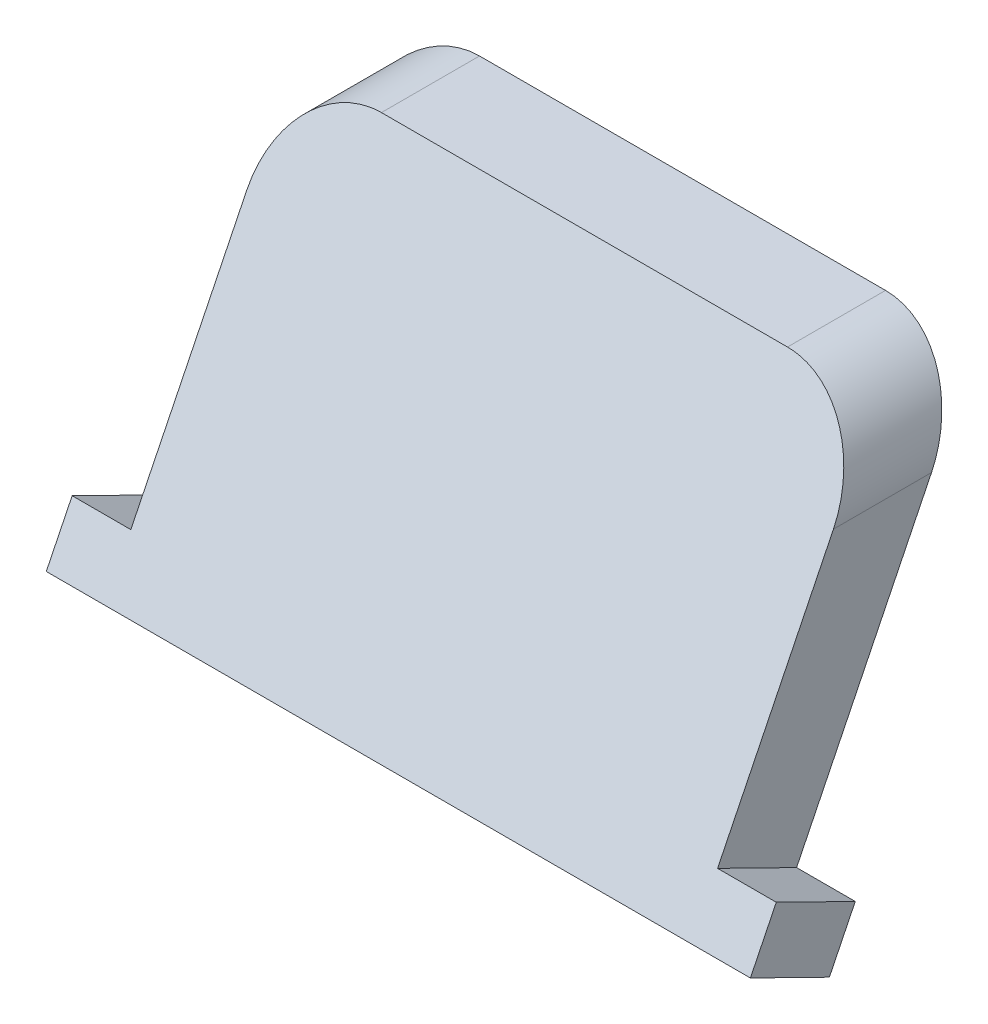
ISO-10303-21;
HEADER;
FILE_DESCRIPTION(('STEP AP214'),'2;1');
FILE_NAME('part.step','',(''),(''),'','','');
FILE_SCHEMA(('AUTOMOTIVE_DESIGN { 1 0 10303 214 1 1 1 1 }'));
ENDSEC;
DATA;
#1=APPLICATION_CONTEXT('core data for automotive mechanical design processes');
#2=APPLICATION_PROTOCOL_DEFINITION('international standard','automotive_design',2000,#1);
#3=PRODUCT_CONTEXT('',#1,'mechanical');
#4=PRODUCT('Part','Part','',(#3));
#5=PRODUCT_RELATED_PRODUCT_CATEGORY('part','',(#4));
#6=PRODUCT_DEFINITION_FORMATION('','',#4);
#7=PRODUCT_DEFINITION_CONTEXT('part definition',#1,'design');
#8=PRODUCT_DEFINITION('design','',#6,#7);
#9=PRODUCT_DEFINITION_SHAPE('','',#8);
#10=(LENGTH_UNIT() NAMED_UNIT(*) SI_UNIT(.MILLI.,.METRE.));
#11=(NAMED_UNIT(*) PLANE_ANGLE_UNIT() SI_UNIT($,.RADIAN.));
#12=(NAMED_UNIT(*) SI_UNIT($,.STERADIAN.) SOLID_ANGLE_UNIT());
#13=UNCERTAINTY_MEASURE_WITH_UNIT(LENGTH_MEASURE(1.E-05),#10,'distance_accuracy_value','');
#14=(GEOMETRIC_REPRESENTATION_CONTEXT(3) GLOBAL_UNCERTAINTY_ASSIGNED_CONTEXT((#13)) GLOBAL_UNIT_ASSIGNED_CONTEXT((#10,
#11,#12)) REPRESENTATION_CONTEXT('',''));
#15=CARTESIAN_POINT('',(0.,0.,0.));
#16=DIRECTION('',(0.,0.,1.));
#17=DIRECTION('',(1.,0.,0.));
#18=AXIS2_PLACEMENT_3D('',#15,#16,#17);
#19=CARTESIAN_POINT('',(-127.,0.,0.));
#20=DIRECTION('',(1.,0.,0.));
#21=DIRECTION('',(0.,0.,-1.));
#22=AXIS2_PLACEMENT_3D('',#19,#20,#21);
#23=PLANE('',#22);
#24=DIRECTION('',(0.,-0.440928700990651,-0.897542133073817));
#25=VECTOR('',#24,1.);
#26=CARTESIAN_POINT('',(-127.,311.889909229583,66.9616760532339));
#27=LINE('',#26,#25);
#28=CARTESIAN_POINT('',(-127.,328.689292737327,101.158031323346));
#29=VERTEX_POINT('',#28);
#30=CARTESIAN_POINT('',(-127.,311.889909229583,66.9616760532339));
#31=VERTEX_POINT('',#30);
#32=EDGE_CURVE('E50',#29,#31,#27,.T.);
#33=ORIENTED_EDGE('',*,*,#32,.F.);
#34=DIRECTION('',(0.,-0.897542133073816,0.440928700990653));
#35=VECTOR('',#34,1.);
#36=CARTESIAN_POINT('',(-127.,342.9,94.1768451900222));
#37=LINE('',#36,#35);
#38=CARTESIAN_POINT('',(-127.,430.784,51.0027405659269));
#39=VERTEX_POINT('',#38);
#40=EDGE_CURVE('E179',#39,#29,#37,.T.);
#41=ORIENTED_EDGE('',*,*,#40,.F.);
#42=DIRECTION('',(0.,0.,1.));
#43=VECTOR('',#42,1.);
#44=CARTESIAN_POINT('',(-127.,430.784,0.));
#45=LINE('',#44,#43);
#46=CARTESIAN_POINT('',(-127.,430.784,8.55347986156453));
#47=VERTEX_POINT('',#46);
#48=EDGE_CURVE('E43',#39,#47,#45,.F.);
#49=ORIENTED_EDGE('',*,*,#48,.T.);
#50=DIRECTION('',(0.,0.897542133073816,-0.440928700990653));
#51=VECTOR('',#50,1.);
#52=CARTESIAN_POINT('',(-127.,342.9,51.7275844856598));
#53=LINE('',#52,#51);
#54=EDGE_CURVE('E56',#31,#47,#53,.T.);
#55=ORIENTED_EDGE('',*,*,#54,.F.);
#56=EDGE_LOOP('',(#33,#41,#49,#55));
#57=FACE_BOUND('',#56,.T.);
#58=ADVANCED_FACE('F35',(#57),#23,.F.);
#59=CARTESIAN_POINT('',(127.,342.9,94.1768451900222));
#60=DIRECTION('',(0.,-0.440928700990653,-0.897542133073816));
#61=DIRECTION('',(0.,0.897542133073816,-0.440928700990653));
#62=AXIS2_PLACEMENT_3D('',#59,#60,#61);
#63=PLANE('',#62);
#64=ORIENTED_EDGE('',*,*,#40,.T.);
#65=DIRECTION('',(1.,0.,0.));
#66=VECTOR('',#65,1.);
#67=CARTESIAN_POINT('',(-152.4,328.689292737327,101.158031323346));
#68=LINE('',#67,#66);
#69=CARTESIAN_POINT('',(-152.4,328.689292737327,101.158031323346));
#70=VERTEX_POINT('',#69);
#71=EDGE_CURVE('E174',#70,#29,#68,.T.);
#72=ORIENTED_EDGE('',*,*,#71,.F.);
#73=DIRECTION('',(0.,0.897542133073818,-0.440928700990649));
#74=VECTOR('',#73,1.);
#75=CARTESIAN_POINT('',(-152.4,305.891722557252,112.357620328509));
#76=LINE('',#75,#74);
#77=CARTESIAN_POINT('',(-152.4,305.891722557252,112.357620328509));
#78=VERTEX_POINT('',#77);
#79=EDGE_CURVE('E167',#78,#70,#76,.T.);
#80=ORIENTED_EDGE('',*,*,#79,.F.);
#81=DIRECTION('',(1.,0.,0.));
#82=VECTOR('',#81,1.);
#83=CARTESIAN_POINT('',(-196.85,305.891722557252,112.357620328509));
#84=LINE('',#83,#82);
#85=CARTESIAN_POINT('',(152.4,305.891722557252,112.357620328509));
#86=VERTEX_POINT('',#85);
#87=EDGE_CURVE('E123',#78,#86,#84,.T.);
#88=ORIENTED_EDGE('',*,*,#87,.T.);
#89=DIRECTION('',(0.,0.897542133073818,-0.440928700990649));
#90=VECTOR('',#89,1.);
#91=CARTESIAN_POINT('',(152.4,305.891722557252,112.357620328509));
#92=LINE('',#91,#90);
#93=CARTESIAN_POINT('',(152.4,328.689292737327,101.158031323346));
#94=VERTEX_POINT('',#93);
#95=EDGE_CURVE('E131',#86,#94,#92,.T.);
#96=ORIENTED_EDGE('',*,*,#95,.T.);
#97=DIRECTION('',(-1.,0.,0.));
#98=VECTOR('',#97,1.);
#99=CARTESIAN_POINT('',(152.4,328.689292737327,101.158031323346));
#100=LINE('',#99,#98);
#101=CARTESIAN_POINT('',(127.,328.689292737327,101.158031323346));
#102=VERTEX_POINT('',#101);
#103=EDGE_CURVE('E145',#94,#102,#100,.T.);
#104=ORIENTED_EDGE('',*,*,#103,.T.);
#105=DIRECTION('',(0.,-0.897542133073816,0.440928700990653));
#106=VECTOR('',#105,1.);
#107=CARTESIAN_POINT('',(127.,342.9,94.1768451900222));
#108=LINE('',#107,#106);
#109=CARTESIAN_POINT('',(127.,430.784,51.0027405659269));
#110=VERTEX_POINT('',#109);
#111=EDGE_CURVE('E150',#110,#102,#108,.T.);
#112=ORIENTED_EDGE('',*,*,#111,.F.);
#113=CARTESIAN_POINT('',(87.884,430.784,51.0027405659269));
#114=DIRECTION('',(0.,0.440928700990653,0.897542133073816));
#115=DIRECTION('',(0.,-0.897542133073816,0.440928700990653));
#116=AXIS2_PLACEMENT_3D('',#113,#114,#115);
#117=ELLIPSE('',#116,43.5812409898121,39.116);
#118=CARTESIAN_POINT('',(87.884,469.9,31.7865205887284));
#119=VERTEX_POINT('',#118);
#120=EDGE_CURVE('E156',#119,#110,#117,.F.);
#121=ORIENTED_EDGE('',*,*,#120,.F.);
#122=DIRECTION('',(-1.,0.,0.));
#123=VECTOR('',#122,1.);
#124=CARTESIAN_POINT('',(127.,469.9,31.7865205887284));
#125=LINE('',#124,#123);
#126=CARTESIAN_POINT('',(-87.884,469.9,31.7865205887284));
#127=VERTEX_POINT('',#126);
#128=EDGE_CURVE('E181',#119,#127,#125,.T.);
#129=ORIENTED_EDGE('',*,*,#128,.T.);
#130=CARTESIAN_POINT('',(-87.884,430.784,51.0027405659269));
#131=DIRECTION('',(0.,-0.440928700990653,-0.897542133073816));
#132=DIRECTION('',(0.,-0.897542133073816,0.440928700990653));
#133=AXIS2_PLACEMENT_3D('',#130,#131,#132);
#134=ELLIPSE('',#133,43.5812409898121,39.116);
#135=EDGE_CURVE('E188',#127,#39,#134,.F.);
#136=ORIENTED_EDGE('',*,*,#135,.T.);
#137=EDGE_LOOP('',(#64,#72,#80,#88,#96,#104,#112,#121,#129,#136));
#138=FACE_BOUND('',#137,.T.);
#139=ADVANCED_FACE('F209',(#138),#63,.F.);
#140=CARTESIAN_POINT('',(127.,342.9,51.7275844856598));
#141=DIRECTION('',(0.,0.440928700990653,0.897542133073816));
#142=DIRECTION('',(0.,-0.897542133073816,0.440928700990653));
#143=AXIS2_PLACEMENT_3D('',#140,#141,#142);
#144=PLANE('',#143);
#145=DIRECTION('',(1.,0.,0.));
#146=VECTOR('',#145,1.);
#147=CARTESIAN_POINT('',(-196.85,289.092339049508,78.1612650583964));
#148=LINE('',#147,#146);
#149=CARTESIAN_POINT('',(-152.4,289.092339049508,78.1612650583964));
#150=VERTEX_POINT('',#149);
#151=CARTESIAN_POINT('',(152.4,289.092339049508,78.1612650583964));
#152=VERTEX_POINT('',#151);
#153=EDGE_CURVE('E113',#150,#152,#148,.T.);
#154=ORIENTED_EDGE('',*,*,#153,.F.);
#155=DIRECTION('',(0.,-0.897542133073818,0.440928700990649));
#156=VECTOR('',#155,1.);
#157=CARTESIAN_POINT('',(-152.4,289.092339049508,78.1612650583964));
#158=LINE('',#157,#156);
#159=CARTESIAN_POINT('',(-152.4,311.889909229583,66.9616760532339));
#160=VERTEX_POINT('',#159);
#161=EDGE_CURVE('E164',#160,#150,#158,.T.);
#162=ORIENTED_EDGE('',*,*,#161,.F.);
#163=DIRECTION('',(1.,0.,0.));
#164=VECTOR('',#163,1.);
#165=CARTESIAN_POINT('',(-152.4,311.889909229583,66.9616760532339));
#166=LINE('',#165,#164);
#167=EDGE_CURVE('E171',#160,#31,#166,.T.);
#168=ORIENTED_EDGE('',*,*,#167,.T.);
#169=ORIENTED_EDGE('',*,*,#54,.T.);
#170=CARTESIAN_POINT('',(-87.884,430.784,8.55347986156452));
#171=DIRECTION('',(0.,0.440928700990653,0.897542133073816));
#172=DIRECTION('',(0.,-0.897542133073816,0.440928700990653));
#173=AXIS2_PLACEMENT_3D('',#170,#171,#172);
#174=ELLIPSE('',#173,43.5812409898121,39.116);
#175=CARTESIAN_POINT('',(-87.884,469.9,-10.6627401156339));
#176=VERTEX_POINT('',#175);
#177=EDGE_CURVE('E12',#47,#176,#174,.F.);
#178=ORIENTED_EDGE('',*,*,#177,.T.);
#179=DIRECTION('',(-1.,0.,0.));
#180=VECTOR('',#179,1.);
#181=CARTESIAN_POINT('',(127.,469.9,-10.6627401156339));
#182=LINE('',#181,#180);
#183=CARTESIAN_POINT('',(87.884,469.9,-10.6627401156339));
#184=VERTEX_POINT('',#183);
#185=EDGE_CURVE('E183',#184,#176,#182,.T.);
#186=ORIENTED_EDGE('',*,*,#185,.F.);
#187=CARTESIAN_POINT('',(87.884,430.784,8.55347986156452));
#188=DIRECTION('',(0.,-0.440928700990653,-0.897542133073816));
#189=DIRECTION('',(0.,-0.897542133073816,0.440928700990653));
#190=AXIS2_PLACEMENT_3D('',#187,#188,#189);
#191=ELLIPSE('',#190,43.5812409898121,39.116);
#192=CARTESIAN_POINT('',(127.,430.784,8.55347986156453));
#193=VERTEX_POINT('',#192);
#194=EDGE_CURVE('E161',#193,#184,#191,.F.);
#195=ORIENTED_EDGE('',*,*,#194,.F.);
#196=DIRECTION('',(0.,0.897542133073816,-0.440928700990653));
#197=VECTOR('',#196,1.);
#198=CARTESIAN_POINT('',(127.,342.9,51.7275844856598));
#199=LINE('',#198,#197);
#200=CARTESIAN_POINT('',(127.,311.889909229583,66.9616760532339));
#201=VERTEX_POINT('',#200);
#202=EDGE_CURVE('E147',#201,#193,#199,.T.);
#203=ORIENTED_EDGE('',*,*,#202,.F.);
#204=DIRECTION('',(-1.,0.,0.));
#205=VECTOR('',#204,1.);
#206=CARTESIAN_POINT('',(152.4,311.889909229583,66.9616760532339));
#207=LINE('',#206,#205);
#208=CARTESIAN_POINT('',(152.4,311.889909229583,66.9616760532339));
#209=VERTEX_POINT('',#208);
#210=EDGE_CURVE('E135',#209,#201,#207,.T.);
#211=ORIENTED_EDGE('',*,*,#210,.F.);
#212=DIRECTION('',(0.,-0.897542133073818,0.440928700990649));
#213=VECTOR('',#212,1.);
#214=CARTESIAN_POINT('',(152.4,289.092339049508,78.1612650583964));
#215=LINE('',#214,#213);
#216=EDGE_CURVE('E128',#209,#152,#215,.T.);
#217=ORIENTED_EDGE('',*,*,#216,.T.);
#218=EDGE_LOOP('',(#154,#162,#168,#169,#178,#186,#195,#203,#211,#217));
#219=FACE_BOUND('',#218,.T.);
#220=ADVANCED_FACE('F133',(#219),#144,.F.);
#221=CARTESIAN_POINT('',(-196.85,292.663861527532,85.4313563362943));
#222=DIRECTION('',(0.,-0.897542133073818,0.440928700990649));
#223=DIRECTION('',(0.,-0.440928700990649,-0.897542133073818));
#224=AXIS2_PLACEMENT_3D('',#221,#222,#223);
#225=PLANE('',#224);
#226=DIRECTION('',(0.,0.440928700990649,0.897542133073818));
#227=VECTOR('',#226,1.);
#228=CARTESIAN_POINT('',(152.4,289.092339049508,78.1612650583964));
#229=LINE('',#228,#227);
#230=EDGE_CURVE('E116',#152,#86,#229,.T.);
#231=ORIENTED_EDGE('',*,*,#230,.T.);
#232=ORIENTED_EDGE('',*,*,#87,.F.);
#233=DIRECTION('',(0.,0.440928700990649,0.897542133073818));
#234=VECTOR('',#233,1.);
#235=CARTESIAN_POINT('',(-152.4,289.092339049508,78.1612650583964));
#236=LINE('',#235,#234);
#237=EDGE_CURVE('E119',#150,#78,#236,.T.);
#238=ORIENTED_EDGE('',*,*,#237,.F.);
#239=ORIENTED_EDGE('',*,*,#153,.T.);
#240=EDGE_LOOP('',(#231,#232,#238,#239));
#241=FACE_BOUND('',#240,.T.);
#242=ADVANCED_FACE('F115',(#241),#225,.T.);
#243=CARTESIAN_POINT('',(127.,469.9,31.7865205887284));
#244=DIRECTION('',(0.,-1.,0.));
#245=DIRECTION('',(0.,0.,-1.));
#246=AXIS2_PLACEMENT_3D('',#243,#244,#245);
#247=PLANE('',#246);
#248=ORIENTED_EDGE('',*,*,#128,.F.);
#249=DIRECTION('',(0.,0.,1.));
#250=VECTOR('',#249,1.);
#251=CARTESIAN_POINT('',(87.884,469.9,31.7865205887284));
#252=LINE('',#251,#250);
#253=EDGE_CURVE('E153',#184,#119,#252,.T.);
#254=ORIENTED_EDGE('',*,*,#253,.F.);
#255=ORIENTED_EDGE('',*,*,#185,.T.);
#256=DIRECTION('',(0.,0.,1.));
#257=VECTOR('',#256,1.);
#258=CARTESIAN_POINT('',(-87.884,469.9,31.7865205887284));
#259=LINE('',#258,#257);
#260=EDGE_CURVE('E185',#176,#127,#259,.T.);
#261=ORIENTED_EDGE('',*,*,#260,.T.);
#262=EDGE_LOOP('',(#248,#254,#255,#261));
#263=FACE_BOUND('',#262,.T.);
#264=ADVANCED_FACE('F196',(#263),#247,.F.);
#265=CARTESIAN_POINT('',(-87.884,430.784,31.7865205887284));
#266=DIRECTION('',(0.,0.,1.));
#267=DIRECTION('',(1.,0.,0.));
#268=AXIS2_PLACEMENT_3D('',#265,#266,#267);
#269=CYLINDRICAL_SURFACE('',#268,39.116);
#270=ORIENTED_EDGE('',*,*,#177,.F.);
#271=ORIENTED_EDGE('',*,*,#48,.F.);
#272=ORIENTED_EDGE('',*,*,#135,.F.);
#273=ORIENTED_EDGE('',*,*,#260,.F.);
#274=EDGE_LOOP('',(#270,#271,#272,#273));
#275=FACE_BOUND('',#274,.T.);
#276=ADVANCED_FACE('F37',(#275),#269,.T.);
#277=CARTESIAN_POINT('',(-152.4,311.889909229583,66.9616760532339));
#278=DIRECTION('',(0.,-0.897542133073817,0.440928700990651));
#279=DIRECTION('',(0.,-0.440928700990651,-0.897542133073817));
#280=AXIS2_PLACEMENT_3D('',#277,#278,#279);
#281=PLANE('',#280);
#282=ORIENTED_EDGE('',*,*,#32,.T.);
#283=ORIENTED_EDGE('',*,*,#167,.F.);
#284=DIRECTION('',(0.,-0.440928700990651,-0.897542133073817));
#285=VECTOR('',#284,1.);
#286=CARTESIAN_POINT('',(-152.4,311.889909229583,66.9616760532339));
#287=LINE('',#286,#285);
#288=EDGE_CURVE('E169',#70,#160,#287,.T.);
#289=ORIENTED_EDGE('',*,*,#288,.F.);
#290=ORIENTED_EDGE('',*,*,#71,.T.);
#291=EDGE_LOOP('',(#282,#283,#289,#290));
#292=FACE_BOUND('',#291,.T.);
#293=ADVANCED_FACE('F217',(#292),#281,.F.);
#294=CARTESIAN_POINT('',(-152.4,0.,0.));
#295=DIRECTION('',(1.,0.,0.));
#296=DIRECTION('',(0.,0.,-1.));
#297=AXIS2_PLACEMENT_3D('',#294,#295,#296);
#298=PLANE('',#297);
#299=ORIENTED_EDGE('',*,*,#161,.T.);
#300=ORIENTED_EDGE('',*,*,#237,.T.);
#301=ORIENTED_EDGE('',*,*,#79,.T.);
#302=ORIENTED_EDGE('',*,*,#288,.T.);
#303=EDGE_LOOP('',(#299,#300,#301,#302));
#304=FACE_BOUND('',#303,.T.);
#305=ADVANCED_FACE('F213',(#304),#298,.F.);
#306=CARTESIAN_POINT('',(127.,0.,0.));
#307=DIRECTION('',(-1.,0.,0.));
#308=DIRECTION('',(0.,0.,-1.));
#309=AXIS2_PLACEMENT_3D('',#306,#307,#308);
#310=PLANE('',#309);
#311=DIRECTION('',(0.,-0.440928700990651,-0.897542133073817));
#312=VECTOR('',#311,1.);
#313=CARTESIAN_POINT('',(127.,311.889909229583,66.9616760532339));
#314=LINE('',#313,#312);
#315=EDGE_CURVE('E136',#102,#201,#314,.T.);
#316=ORIENTED_EDGE('',*,*,#315,.T.);
#317=ORIENTED_EDGE('',*,*,#202,.T.);
#318=DIRECTION('',(0.,0.,1.));
#319=VECTOR('',#318,1.);
#320=CARTESIAN_POINT('',(127.,430.784,0.));
#321=LINE('',#320,#319);
#322=EDGE_CURVE('E158',#110,#193,#321,.F.);
#323=ORIENTED_EDGE('',*,*,#322,.F.);
#324=ORIENTED_EDGE('',*,*,#111,.T.);
#325=EDGE_LOOP('',(#316,#317,#323,#324));
#326=FACE_BOUND('',#325,.T.);
#327=ADVANCED_FACE('F203',(#326),#310,.F.);
#328=CARTESIAN_POINT('',(87.884,430.784,31.7865205887284));
#329=DIRECTION('',(0.,0.,1.));
#330=DIRECTION('',(-1.,0.,0.));
#331=AXIS2_PLACEMENT_3D('',#328,#329,#330);
#332=CYLINDRICAL_SURFACE('',#331,39.116);
#333=ORIENTED_EDGE('',*,*,#194,.T.);
#334=ORIENTED_EDGE('',*,*,#253,.T.);
#335=ORIENTED_EDGE('',*,*,#120,.T.);
#336=ORIENTED_EDGE('',*,*,#322,.T.);
#337=EDGE_LOOP('',(#333,#334,#335,#336));
#338=FACE_BOUND('',#337,.T.);
#339=ADVANCED_FACE('F199',(#338),#332,.T.);
#340=CARTESIAN_POINT('',(152.4,311.889909229583,66.9616760532339));
#341=DIRECTION('',(0.,-0.897542133073817,0.440928700990651));
#342=DIRECTION('',(0.,-0.440928700990651,-0.897542133073817));
#343=AXIS2_PLACEMENT_3D('',#340,#341,#342);
#344=PLANE('',#343);
#345=ORIENTED_EDGE('',*,*,#315,.F.);
#346=ORIENTED_EDGE('',*,*,#103,.F.);
#347=DIRECTION('',(0.,-0.440928700990651,-0.897542133073817));
#348=VECTOR('',#347,1.);
#349=CARTESIAN_POINT('',(152.4,311.889909229583,66.9616760532339));
#350=LINE('',#349,#348);
#351=EDGE_CURVE('E142',#94,#209,#350,.T.);
#352=ORIENTED_EDGE('',*,*,#351,.T.);
#353=ORIENTED_EDGE('',*,*,#210,.T.);
#354=EDGE_LOOP('',(#345,#346,#352,#353));
#355=FACE_BOUND('',#354,.T.);
#356=ADVANCED_FACE('F207',(#355),#344,.F.);
#357=CARTESIAN_POINT('',(152.4,0.,0.));
#358=DIRECTION('',(-1.,0.,0.));
#359=DIRECTION('',(0.,0.,-1.));
#360=AXIS2_PLACEMENT_3D('',#357,#358,#359);
#361=PLANE('',#360);
#362=ORIENTED_EDGE('',*,*,#216,.F.);
#363=ORIENTED_EDGE('',*,*,#351,.F.);
#364=ORIENTED_EDGE('',*,*,#95,.F.);
#365=ORIENTED_EDGE('',*,*,#230,.F.);
#366=EDGE_LOOP('',(#362,#363,#364,#365));
#367=FACE_BOUND('',#366,.T.);
#368=ADVANCED_FACE('F127',(#367),#361,.F.);
#369=CLOSED_SHELL('',(#58,#139,#220,#242,#264,#276,#293,#305,#327,#339,#356,#368));
#370=MANIFOLD_SOLID_BREP('B2',#369);
#371=ADVANCED_BREP_SHAPE_REPRESENTATION('',(#18,#370),#14);
#372=SHAPE_DEFINITION_REPRESENTATION(#9,#371);
ENDSEC;
END-ISO-10303-21;
